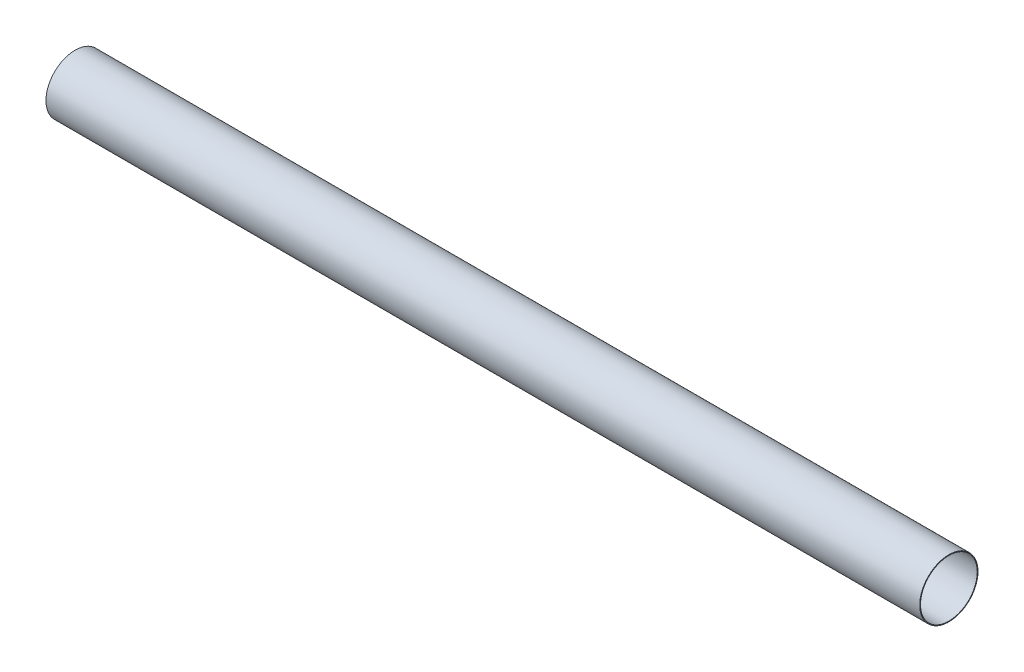
ISO-10303-21;
HEADER;
FILE_DESCRIPTION(('STEP AP214'),'2;1');
FILE_NAME('part.step','',(''),(''),'','','');
FILE_SCHEMA(('AUTOMOTIVE_DESIGN { 1 0 10303 214 1 1 1 1 }'));
ENDSEC;
DATA;
#1=APPLICATION_CONTEXT('core data for automotive mechanical design processes');
#2=APPLICATION_PROTOCOL_DEFINITION('international standard','automotive_design',2000,#1);
#3=PRODUCT_CONTEXT('',#1,'mechanical');
#4=PRODUCT('Part','Part','',(#3));
#5=PRODUCT_RELATED_PRODUCT_CATEGORY('part','',(#4));
#6=PRODUCT_DEFINITION_FORMATION('','',#4);
#7=PRODUCT_DEFINITION_CONTEXT('part definition',#1,'design');
#8=PRODUCT_DEFINITION('design','',#6,#7);
#9=PRODUCT_DEFINITION_SHAPE('','',#8);
#10=(LENGTH_UNIT() NAMED_UNIT(*) SI_UNIT(.MILLI.,.METRE.));
#11=(NAMED_UNIT(*) PLANE_ANGLE_UNIT() SI_UNIT($,.RADIAN.));
#12=(NAMED_UNIT(*) SI_UNIT($,.STERADIAN.) SOLID_ANGLE_UNIT());
#13=UNCERTAINTY_MEASURE_WITH_UNIT(LENGTH_MEASURE(1.E-05),#10,'distance_accuracy_value','');
#14=(GEOMETRIC_REPRESENTATION_CONTEXT(3) GLOBAL_UNCERTAINTY_ASSIGNED_CONTEXT((#13)) GLOBAL_UNIT_ASSIGNED_CONTEXT((#10,
#11,#12)) REPRESENTATION_CONTEXT('',''));
#15=CARTESIAN_POINT('',(0.,0.,0.));
#16=DIRECTION('',(0.,0.,1.));
#17=DIRECTION('',(1.,0.,0.));
#18=AXIS2_PLACEMENT_3D('',#15,#16,#17);
#19=CARTESIAN_POINT('',(4572.,0.,0.));
#20=DIRECTION('',(1.,0.,0.));
#21=DIRECTION('',(0.,0.,-1.));
#22=AXIS2_PLACEMENT_3D('',#19,#20,#21);
#23=PLANE('',#22);
#24=CARTESIAN_POINT('',(4572.,0.,0.));
#25=DIRECTION('',(1.,0.,0.));
#26=DIRECTION('',(0.,0.,-1.));
#27=AXIS2_PLACEMENT_3D('',#24,#25,#26);
#28=CIRCLE('',#27,152.4);
#29=CARTESIAN_POINT('',(4572.,0.,-152.4));
#30=VERTEX_POINT('',#29);
#31=EDGE_CURVE('E10',#30,#30,#28,.T.);
#32=ORIENTED_EDGE('',*,*,#31,.T.);
#33=EDGE_LOOP('',(#32));
#34=FACE_BOUND('',#33,.T.);
#35=CARTESIAN_POINT('',(4572.,0.,0.));
#36=DIRECTION('',(1.,0.,0.));
#37=DIRECTION('',(0.,0.,-1.));
#38=AXIS2_PLACEMENT_3D('',#35,#36,#37);
#39=CIRCLE('',#38,148.59);
#40=CARTESIAN_POINT('',(4572.,0.,-148.59));
#41=VERTEX_POINT('',#40);
#42=EDGE_CURVE('E45',#41,#41,#39,.T.);
#43=ORIENTED_EDGE('',*,*,#42,.F.);
#44=EDGE_LOOP('',(#43));
#45=FACE_BOUND('',#44,.T.);
#46=ADVANCED_FACE('F34',(#34,#45),#23,.T.);
#47=CARTESIAN_POINT('',(0.,0.,0.));
#48=DIRECTION('',(1.,0.,0.));
#49=DIRECTION('',(0.,0.,-1.));
#50=AXIS2_PLACEMENT_3D('',#47,#48,#49);
#51=PLANE('',#50);
#52=CARTESIAN_POINT('',(0.,0.,0.));
#53=DIRECTION('',(1.,0.,0.));
#54=DIRECTION('',(0.,0.,-1.));
#55=AXIS2_PLACEMENT_3D('',#52,#53,#54);
#56=CIRCLE('',#55,152.4);
#57=CARTESIAN_POINT('',(0.,0.,-152.4));
#58=VERTEX_POINT('',#57);
#59=EDGE_CURVE('E38',#58,#58,#56,.T.);
#60=ORIENTED_EDGE('',*,*,#59,.F.);
#61=EDGE_LOOP('',(#60));
#62=FACE_BOUND('',#61,.T.);
#63=CARTESIAN_POINT('',(0.,0.,0.));
#64=DIRECTION('',(1.,0.,0.));
#65=DIRECTION('',(0.,0.,-1.));
#66=AXIS2_PLACEMENT_3D('',#63,#64,#65);
#67=CIRCLE('',#66,148.59);
#68=CARTESIAN_POINT('',(0.,0.,-148.59));
#69=VERTEX_POINT('',#68);
#70=EDGE_CURVE('E47',#69,#69,#67,.T.);
#71=ORIENTED_EDGE('',*,*,#70,.T.);
#72=EDGE_LOOP('',(#71));
#73=FACE_BOUND('',#72,.T.);
#74=ADVANCED_FACE('F57',(#62,#73),#51,.F.);
#75=CARTESIAN_POINT('',(4572.,0.,0.));
#76=DIRECTION('',(-1.,0.,0.));
#77=DIRECTION('',(0.,0.,1.));
#78=AXIS2_PLACEMENT_3D('',#75,#76,#77);
#79=CYLINDRICAL_SURFACE('',#78,152.4);
#80=ORIENTED_EDGE('',*,*,#31,.F.);
#81=EDGE_LOOP('',(#80));
#82=FACE_BOUND('',#81,.T.);
#83=ORIENTED_EDGE('',*,*,#59,.T.);
#84=EDGE_LOOP('',(#83));
#85=FACE_BOUND('',#84,.T.);
#86=ADVANCED_FACE('F36',(#82,#85),#79,.T.);
#87=CARTESIAN_POINT('',(4572.,0.,0.));
#88=DIRECTION('',(-1.,0.,0.));
#89=DIRECTION('',(0.,0.,1.));
#90=AXIS2_PLACEMENT_3D('',#87,#88,#89);
#91=CYLINDRICAL_SURFACE('',#90,148.59);
#92=ORIENTED_EDGE('',*,*,#42,.T.);
#93=EDGE_LOOP('',(#92));
#94=FACE_BOUND('',#93,.T.);
#95=ORIENTED_EDGE('',*,*,#70,.F.);
#96=EDGE_LOOP('',(#95));
#97=FACE_BOUND('',#96,.T.);
#98=ADVANCED_FACE('F53',(#94,#97),#91,.F.);
#99=CLOSED_SHELL('',(#46,#74,#86,#98));
#100=MANIFOLD_SOLID_BREP('B2',#99);
#101=ADVANCED_BREP_SHAPE_REPRESENTATION('',(#18,#100),#14);
#102=SHAPE_DEFINITION_REPRESENTATION(#9,#101);
ENDSEC;
END-ISO-10303-21;
